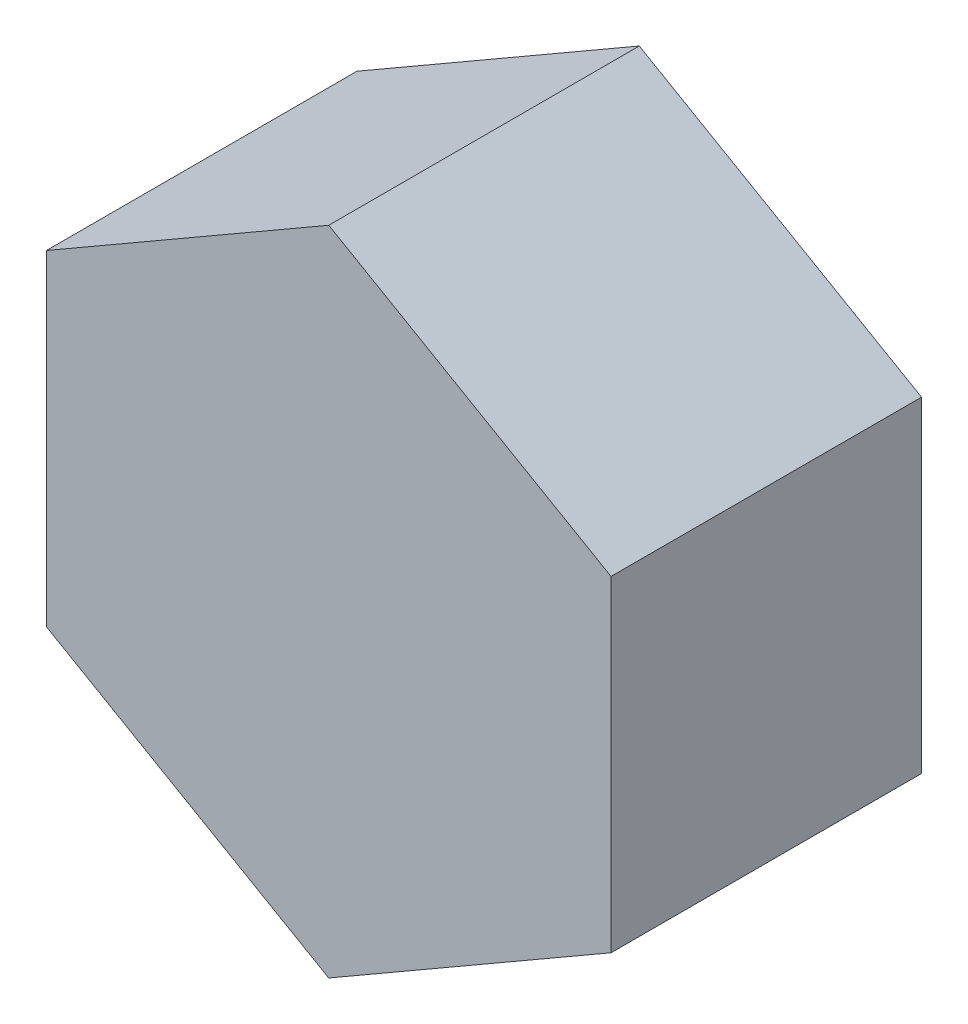
ISO-10303-21;
HEADER;
FILE_DESCRIPTION(('STEP AP214'),'2;1');
FILE_NAME('part.step','',(''),(''),'','','');
FILE_SCHEMA(('AUTOMOTIVE_DESIGN { 1 0 10303 214 1 1 1 1 }'));
ENDSEC;
DATA;
#1=APPLICATION_CONTEXT('core data for automotive mechanical design processes');
#2=APPLICATION_PROTOCOL_DEFINITION('international standard','automotive_design',2000,#1);
#3=PRODUCT_CONTEXT('',#1,'mechanical');
#4=PRODUCT('Part','Part','',(#3));
#5=PRODUCT_RELATED_PRODUCT_CATEGORY('part','',(#4));
#6=PRODUCT_DEFINITION_FORMATION('','',#4);
#7=PRODUCT_DEFINITION_CONTEXT('part definition',#1,'design');
#8=PRODUCT_DEFINITION('design','',#6,#7);
#9=PRODUCT_DEFINITION_SHAPE('','',#8);
#10=(LENGTH_UNIT() NAMED_UNIT(*) SI_UNIT(.MILLI.,.METRE.));
#11=(NAMED_UNIT(*) PLANE_ANGLE_UNIT() SI_UNIT($,.RADIAN.));
#12=(NAMED_UNIT(*) SI_UNIT($,.STERADIAN.) SOLID_ANGLE_UNIT());
#13=UNCERTAINTY_MEASURE_WITH_UNIT(LENGTH_MEASURE(1.E-05),#10,'distance_accuracy_value','');
#14=(GEOMETRIC_REPRESENTATION_CONTEXT(3) GLOBAL_UNCERTAINTY_ASSIGNED_CONTEXT((#13)) GLOBAL_UNIT_ASSIGNED_CONTEXT((#10,
#11,#12)) REPRESENTATION_CONTEXT('',''));
#15=CARTESIAN_POINT('',(0.,0.,0.));
#16=DIRECTION('',(0.,0.,1.));
#17=DIRECTION('',(1.,0.,0.));
#18=AXIS2_PLACEMENT_3D('',#15,#16,#17);
#19=CARTESIAN_POINT('',(12.7,7.33234841870825,13.97));
#20=DIRECTION('',(-0.5,-0.866025403784439,0.));
#21=DIRECTION('',(0.866025403784439,-0.5,0.));
#22=AXIS2_PLACEMENT_3D('',#19,#20,#21);
#23=PLANE('',#22);
#24=DIRECTION('',(-0.866025403784439,0.5,0.));
#25=VECTOR('',#24,1.);
#26=CARTESIAN_POINT('',(12.7,7.33234841870825,0.));
#27=LINE('',#26,#25);
#28=CARTESIAN_POINT('',(12.7,7.33234841870825,0.));
#29=VERTEX_POINT('',#28);
#30=CARTESIAN_POINT('',(0.,14.6646968374165,0.));
#31=VERTEX_POINT('',#30);
#32=EDGE_CURVE('E134',#29,#31,#27,.T.);
#33=ORIENTED_EDGE('',*,*,#32,.T.);
#34=DIRECTION('',(0.,0.,-1.));
#35=VECTOR('',#34,1.);
#36=CARTESIAN_POINT('',(1.66533453693773E-13,14.6646968374165,13.97));
#37=LINE('',#36,#35);
#38=CARTESIAN_POINT('',(1.66533453693773E-13,14.6646968374165,13.97));
#39=VERTEX_POINT('',#38);
#40=EDGE_CURVE('E11',#39,#31,#37,.T.);
#41=ORIENTED_EDGE('',*,*,#40,.F.);
#42=DIRECTION('',(-0.866025403784439,0.5,0.));
#43=VECTOR('',#42,1.);
#44=CARTESIAN_POINT('',(12.7,7.33234841870825,13.97));
#45=LINE('',#44,#43);
#46=CARTESIAN_POINT('',(12.7,7.33234841870825,13.97));
#47=VERTEX_POINT('',#46);
#48=EDGE_CURVE('E151',#47,#39,#45,.T.);
#49=ORIENTED_EDGE('',*,*,#48,.F.);
#50=DIRECTION('',(0.,0.,-1.));
#51=VECTOR('',#50,1.);
#52=CARTESIAN_POINT('',(12.7,7.33234841870825,13.97));
#53=LINE('',#52,#51);
#54=EDGE_CURVE('E130',#47,#29,#53,.T.);
#55=ORIENTED_EDGE('',*,*,#54,.T.);
#56=EDGE_LOOP('',(#33,#41,#49,#55));
#57=FACE_BOUND('',#56,.T.);
#58=ADVANCED_FACE('F44',(#57),#23,.F.);
#59=CARTESIAN_POINT('',(1.66533453693773E-13,14.6646968374165,13.97));
#60=DIRECTION('',(0.5,-0.866025403784438,0.));
#61=DIRECTION('',(0.866025403784439,0.5,0.));
#62=AXIS2_PLACEMENT_3D('',#59,#60,#61);
#63=PLANE('',#62);
#64=DIRECTION('',(-0.866025403784438,-0.5,0.));
#65=VECTOR('',#64,1.);
#66=CARTESIAN_POINT('',(0.,14.6646968374165,0.));
#67=LINE('',#66,#65);
#68=CARTESIAN_POINT('',(-12.7,7.33234841870825,0.));
#69=VERTEX_POINT('',#68);
#70=EDGE_CURVE('E138',#31,#69,#67,.T.);
#71=ORIENTED_EDGE('',*,*,#70,.T.);
#72=DIRECTION('',(0.,0.,-1.));
#73=VECTOR('',#72,1.);
#74=CARTESIAN_POINT('',(-12.7,7.33234841870825,13.97));
#75=LINE('',#74,#73);
#76=CARTESIAN_POINT('',(-12.7,7.33234841870825,13.97));
#77=VERTEX_POINT('',#76);
#78=EDGE_CURVE('E53',#77,#69,#75,.T.);
#79=ORIENTED_EDGE('',*,*,#78,.F.);
#80=DIRECTION('',(-0.866025403784438,-0.5,0.));
#81=VECTOR('',#80,1.);
#82=CARTESIAN_POINT('',(1.66533453693773E-13,14.6646968374165,13.97));
#83=LINE('',#82,#81);
#84=EDGE_CURVE('E98',#39,#77,#83,.T.);
#85=ORIENTED_EDGE('',*,*,#84,.F.);
#86=ORIENTED_EDGE('',*,*,#40,.T.);
#87=EDGE_LOOP('',(#71,#79,#85,#86));
#88=FACE_BOUND('',#87,.T.);
#89=ADVANCED_FACE('F181',(#88),#63,.F.);
#90=CARTESIAN_POINT('',(-12.7,7.33234841870825,13.97));
#91=DIRECTION('',(1.,0.,0.));
#92=DIRECTION('',(0.,1.,0.));
#93=AXIS2_PLACEMENT_3D('',#90,#91,#92);
#94=PLANE('',#93);
#95=DIRECTION('',(0.,-1.,0.));
#96=VECTOR('',#95,1.);
#97=CARTESIAN_POINT('',(-12.7,7.33234841870825,0.));
#98=LINE('',#97,#96);
#99=CARTESIAN_POINT('',(-12.7,-7.33234841870825,0.));
#100=VERTEX_POINT('',#99);
#101=EDGE_CURVE('E142',#69,#100,#98,.T.);
#102=ORIENTED_EDGE('',*,*,#101,.T.);
#103=DIRECTION('',(0.,0.,-1.));
#104=VECTOR('',#103,1.);
#105=CARTESIAN_POINT('',(-12.7,-7.33234841870825,13.97));
#106=LINE('',#105,#104);
#107=CARTESIAN_POINT('',(-12.7,-7.33234841870825,13.97));
#108=VERTEX_POINT('',#107);
#109=EDGE_CURVE('E122',#108,#100,#106,.T.);
#110=ORIENTED_EDGE('',*,*,#109,.F.);
#111=DIRECTION('',(0.,-1.,0.));
#112=VECTOR('',#111,1.);
#113=CARTESIAN_POINT('',(-12.7,7.33234841870825,13.97));
#114=LINE('',#113,#112);
#115=EDGE_CURVE('E111',#77,#108,#114,.T.);
#116=ORIENTED_EDGE('',*,*,#115,.F.);
#117=ORIENTED_EDGE('',*,*,#78,.T.);
#118=EDGE_LOOP('',(#102,#110,#116,#117));
#119=FACE_BOUND('',#118,.T.);
#120=ADVANCED_FACE('F162',(#119),#94,.F.);
#121=CARTESIAN_POINT('',(-12.7,-7.33234841870825,13.97));
#122=DIRECTION('',(0.5,0.866025403784439,0.));
#123=DIRECTION('',(-0.866025403784439,0.5,0.));
#124=AXIS2_PLACEMENT_3D('',#121,#122,#123);
#125=PLANE('',#124);
#126=DIRECTION('',(0.866025403784439,-0.5,0.));
#127=VECTOR('',#126,1.);
#128=CARTESIAN_POINT('',(-12.7,-7.33234841870825,0.));
#129=LINE('',#128,#127);
#130=CARTESIAN_POINT('',(0.,-14.6646968374165,0.));
#131=VERTEX_POINT('',#130);
#132=EDGE_CURVE('E120',#100,#131,#129,.T.);
#133=ORIENTED_EDGE('',*,*,#132,.T.);
#134=DIRECTION('',(0.,0.,-1.));
#135=VECTOR('',#134,1.);
#136=CARTESIAN_POINT('',(1.94289029309402E-13,-14.6646968374165,13.97));
#137=LINE('',#136,#135);
#138=CARTESIAN_POINT('',(1.94289029309402E-13,-14.6646968374165,13.97));
#139=VERTEX_POINT('',#138);
#140=EDGE_CURVE('E117',#139,#131,#137,.T.);
#141=ORIENTED_EDGE('',*,*,#140,.F.);
#142=DIRECTION('',(0.866025403784439,-0.5,0.));
#143=VECTOR('',#142,1.);
#144=CARTESIAN_POINT('',(-12.7,-7.33234841870825,13.97));
#145=LINE('',#144,#143);
#146=EDGE_CURVE('E105',#108,#139,#145,.T.);
#147=ORIENTED_EDGE('',*,*,#146,.F.);
#148=ORIENTED_EDGE('',*,*,#109,.T.);
#149=EDGE_LOOP('',(#133,#141,#147,#148));
#150=FACE_BOUND('',#149,.T.);
#151=ADVANCED_FACE('F118',(#150),#125,.F.);
#152=CARTESIAN_POINT('',(1.94289029309402E-13,-14.6646968374165,13.97));
#153=DIRECTION('',(-0.5,0.866025403784439,0.));
#154=DIRECTION('',(-0.866025403784439,-0.5,0.));
#155=AXIS2_PLACEMENT_3D('',#152,#153,#154);
#156=PLANE('',#155);
#157=DIRECTION('',(0.866025403784439,0.5,0.));
#158=VECTOR('',#157,1.);
#159=CARTESIAN_POINT('',(0.,-14.6646968374165,0.));
#160=LINE('',#159,#158);
#161=CARTESIAN_POINT('',(12.7,-7.33234841870825,0.));
#162=VERTEX_POINT('',#161);
#163=EDGE_CURVE('E84',#131,#162,#160,.T.);
#164=ORIENTED_EDGE('',*,*,#163,.T.);
#165=DIRECTION('',(0.,0.,-1.));
#166=VECTOR('',#165,1.);
#167=CARTESIAN_POINT('',(12.7,-7.33234841870825,13.97));
#168=LINE('',#167,#166);
#169=CARTESIAN_POINT('',(12.7,-7.33234841870825,13.97));
#170=VERTEX_POINT('',#169);
#171=EDGE_CURVE('E123',#170,#162,#168,.T.);
#172=ORIENTED_EDGE('',*,*,#171,.F.);
#173=DIRECTION('',(0.866025403784439,0.5,0.));
#174=VECTOR('',#173,1.);
#175=CARTESIAN_POINT('',(1.94289029309402E-13,-14.6646968374165,13.97));
#176=LINE('',#175,#174);
#177=EDGE_CURVE('E109',#139,#170,#176,.T.);
#178=ORIENTED_EDGE('',*,*,#177,.F.);
#179=ORIENTED_EDGE('',*,*,#140,.T.);
#180=EDGE_LOOP('',(#164,#172,#178,#179));
#181=FACE_BOUND('',#180,.T.);
#182=ADVANCED_FACE('F125',(#181),#156,.F.);
#183=CARTESIAN_POINT('',(12.7,-7.33234841870825,13.97));
#184=DIRECTION('',(-1.,0.,0.));
#185=DIRECTION('',(0.,-1.,0.));
#186=AXIS2_PLACEMENT_3D('',#183,#184,#185);
#187=PLANE('',#186);
#188=DIRECTION('',(0.,1.,0.));
#189=VECTOR('',#188,1.);
#190=CARTESIAN_POINT('',(12.7,-7.33234841870825,0.));
#191=LINE('',#190,#189);
#192=EDGE_CURVE('E90',#162,#29,#191,.T.);
#193=ORIENTED_EDGE('',*,*,#192,.T.);
#194=ORIENTED_EDGE('',*,*,#54,.F.);
#195=DIRECTION('',(0.,1.,0.));
#196=VECTOR('',#195,1.);
#197=CARTESIAN_POINT('',(12.7,-7.33234841870825,13.97));
#198=LINE('',#197,#196);
#199=EDGE_CURVE('E61',#170,#47,#198,.T.);
#200=ORIENTED_EDGE('',*,*,#199,.F.);
#201=ORIENTED_EDGE('',*,*,#171,.T.);
#202=EDGE_LOOP('',(#193,#194,#200,#201));
#203=FACE_BOUND('',#202,.T.);
#204=ADVANCED_FACE('F170',(#203),#187,.F.);
#205=CARTESIAN_POINT('',(1.94289029309402E-13,0.,13.97));
#206=DIRECTION('',(0.,0.,1.));
#207=DIRECTION('',(1.,0.,0.));
#208=AXIS2_PLACEMENT_3D('',#205,#206,#207);
#209=PLANE('',#208);
#210=ORIENTED_EDGE('',*,*,#48,.T.);
#211=ORIENTED_EDGE('',*,*,#84,.T.);
#212=ORIENTED_EDGE('',*,*,#115,.T.);
#213=ORIENTED_EDGE('',*,*,#146,.T.);
#214=ORIENTED_EDGE('',*,*,#177,.T.);
#215=ORIENTED_EDGE('',*,*,#199,.T.);
#216=EDGE_LOOP('',(#210,#211,#212,#213,#214,#215));
#217=FACE_BOUND('',#216,.T.);
#218=ADVANCED_FACE('F107',(#217),#209,.T.);
#219=CARTESIAN_POINT('',(0.,0.,0.));
#220=DIRECTION('',(0.,0.,1.));
#221=DIRECTION('',(1.,0.,0.));
#222=AXIS2_PLACEMENT_3D('',#219,#220,#221);
#223=PLANE('',#222);
#224=ORIENTED_EDGE('',*,*,#32,.F.);
#225=ORIENTED_EDGE('',*,*,#192,.F.);
#226=ORIENTED_EDGE('',*,*,#163,.F.);
#227=ORIENTED_EDGE('',*,*,#132,.F.);
#228=ORIENTED_EDGE('',*,*,#101,.F.);
#229=ORIENTED_EDGE('',*,*,#70,.F.);
#230=EDGE_LOOP('',(#224,#225,#226,#227,#228,#229));
#231=FACE_BOUND('',#230,.T.);
#232=CARTESIAN_POINT('',(0.,0.,0.));
#233=DIRECTION('',(0.,0.,1.));
#234=DIRECTION('',(1.,0.,0.));
#235=AXIS2_PLACEMENT_3D('',#232,#233,#234);
#236=CIRCLE('',#235,5.47988678424018);
#237=CARTESIAN_POINT('',(5.47988678424018,0.,0.));
#238=VERTEX_POINT('',#237);
#239=EDGE_CURVE('E139',#238,#238,#236,.T.);
#240=ORIENTED_EDGE('',*,*,#239,.T.);
#241=EDGE_LOOP('',(#240));
#242=FACE_BOUND('',#241,.T.);
#243=ADVANCED_FACE('F165',(#231,#242),#223,.F.);
#244=CARTESIAN_POINT('',(0.,0.,0.126999999999988));
#245=DIRECTION('',(0.,0.,1.));
#246=DIRECTION('',(1.,0.,0.));
#247=AXIS2_PLACEMENT_3D('',#244,#245,#246);
#248=TOROIDAL_SURFACE('',#247,5.47988678424018,0.127);
#249=CARTESIAN_POINT('',(0.,0.,0.194703499705129));
#250=DIRECTION('',(0.,0.,1.));
#251=DIRECTION('',(1.,0.,0.));
#252=AXIS2_PLACEMENT_3D('',#249,#250,#251);
#253=CIRCLE('',#252,5.37243802376488);
#254=CARTESIAN_POINT('',(5.37243802376488,0.,0.194703499705129));
#255=VERTEX_POINT('',#254);
#256=EDGE_CURVE('E242',#255,#255,#253,.T.);
#257=ORIENTED_EDGE('',*,*,#256,.T.);
#258=EDGE_LOOP('',(#257));
#259=FACE_BOUND('',#258,.T.);
#260=ORIENTED_EDGE('',*,*,#239,.F.);
#261=EDGE_LOOP('',(#260));
#262=FACE_BOUND('',#261,.T.);
#263=ADVANCED_FACE('F218',(#259,#262),#248,.T.);
#264=CARTESIAN_POINT('',(0.,0.,3.57987848496147));
#265=DIRECTION('',(0.,0.,1.));
#266=DIRECTION('',(0.,1.,0.));
#267=AXIS2_PLACEMENT_3D('',#264,#265,#266);
#268=SPHERICAL_SURFACE('',#267,6.35);
#269=ORIENTED_EDGE('',*,*,#256,.F.);
#270=EDGE_LOOP('',(#269));
#271=FACE_BOUND('',#270,.T.);
#272=ADVANCED_FACE('F226',(#271),#268,.F.);
#273=CLOSED_SHELL('',(#58,#89,#120,#151,#182,#204,#218,#243,#263,#272));
#274=MANIFOLD_SOLID_BREP('B2',#273);
#275=ADVANCED_BREP_SHAPE_REPRESENTATION('',(#18,#274),#14);
#276=SHAPE_DEFINITION_REPRESENTATION(#9,#275);
ENDSEC;
END-ISO-10303-21;
